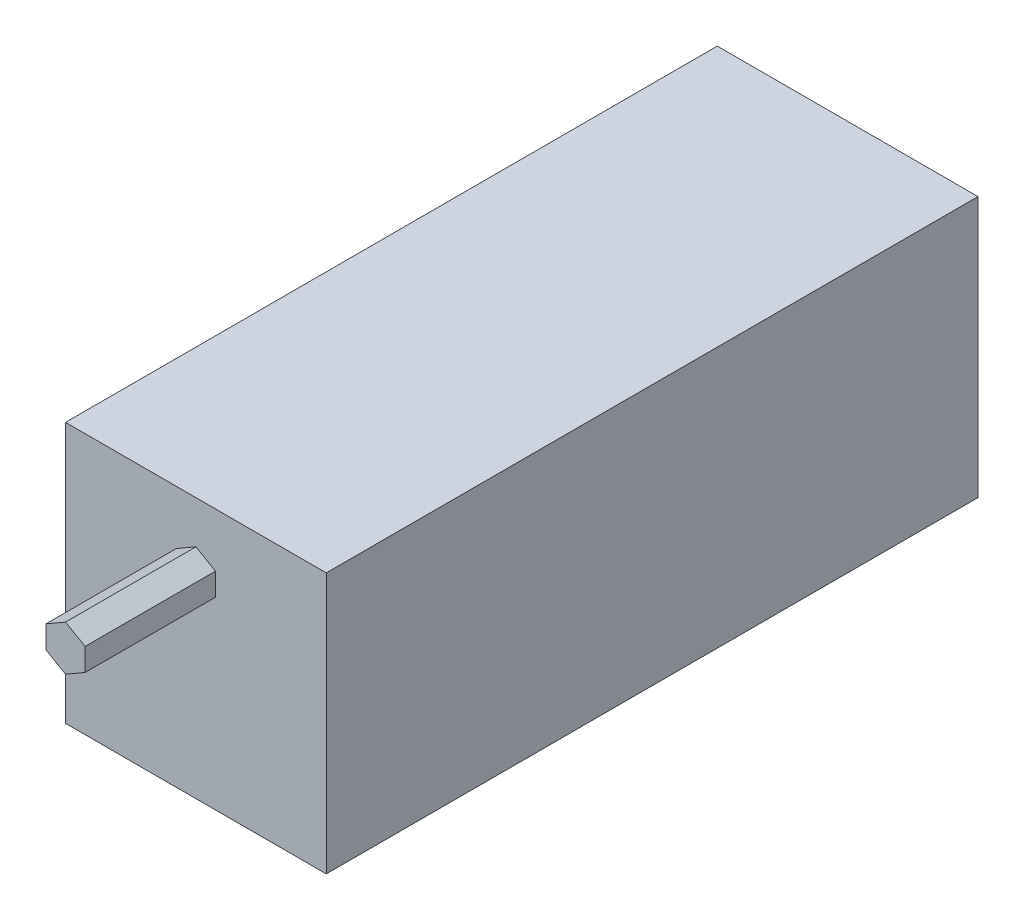
ISO-10303-21;
HEADER;
FILE_DESCRIPTION(('STEP AP214'),'2;1');
FILE_NAME('part.step','',(''),(''),'','','');
FILE_SCHEMA(('AUTOMOTIVE_DESIGN { 1 0 10303 214 1 1 1 1 }'));
ENDSEC;
DATA;
#1=APPLICATION_CONTEXT('core data for automotive mechanical design processes');
#2=APPLICATION_PROTOCOL_DEFINITION('international standard','automotive_design',2000,#1);
#3=PRODUCT_CONTEXT('',#1,'mechanical');
#4=PRODUCT('Part','Part','',(#3));
#5=PRODUCT_RELATED_PRODUCT_CATEGORY('part','',(#4));
#6=PRODUCT_DEFINITION_FORMATION('','',#4);
#7=PRODUCT_DEFINITION_CONTEXT('part definition',#1,'design');
#8=PRODUCT_DEFINITION('design','',#6,#7);
#9=PRODUCT_DEFINITION_SHAPE('','',#8);
#10=(LENGTH_UNIT() NAMED_UNIT(*) SI_UNIT(.MILLI.,.METRE.));
#11=(NAMED_UNIT(*) PLANE_ANGLE_UNIT() SI_UNIT($,.RADIAN.));
#12=(NAMED_UNIT(*) SI_UNIT($,.STERADIAN.) SOLID_ANGLE_UNIT());
#13=UNCERTAINTY_MEASURE_WITH_UNIT(LENGTH_MEASURE(1.E-05),#10,'distance_accuracy_value','');
#14=(GEOMETRIC_REPRESENTATION_CONTEXT(3) GLOBAL_UNCERTAINTY_ASSIGNED_CONTEXT((#13)) GLOBAL_UNIT_ASSIGNED_CONTEXT((#10,
#11,#12)) REPRESENTATION_CONTEXT('',''));
#15=CARTESIAN_POINT('',(0.,0.,0.));
#16=DIRECTION('',(0.,0.,1.));
#17=DIRECTION('',(1.,0.,0.));
#18=AXIS2_PLACEMENT_3D('',#15,#16,#17);
#19=CARTESIAN_POINT('',(0.,40.,0.));
#20=DIRECTION('',(0.,0.,-1.));
#21=DIRECTION('',(-1.,0.,0.));
#22=AXIS2_PLACEMENT_3D('',#19,#20,#21);
#23=PLANE('',#22);
#24=DIRECTION('',(1.,0.,0.));
#25=VECTOR('',#24,1.);
#26=CARTESIAN_POINT('',(0.,0.,0.));
#27=LINE('',#26,#25);
#28=CARTESIAN_POINT('',(0.,0.,0.));
#29=VERTEX_POINT('',#28);
#30=CARTESIAN_POINT('',(40.,0.,0.));
#31=VERTEX_POINT('',#30);
#32=EDGE_CURVE('E137',#29,#31,#27,.T.);
#33=ORIENTED_EDGE('',*,*,#32,.T.);
#34=DIRECTION('',(0.,-1.,0.));
#35=VECTOR('',#34,1.);
#36=CARTESIAN_POINT('',(40.,40.,0.));
#37=LINE('',#36,#35);
#38=CARTESIAN_POINT('',(40.,40.,0.));
#39=VERTEX_POINT('',#38);
#40=EDGE_CURVE('E44',#39,#31,#37,.T.);
#41=ORIENTED_EDGE('',*,*,#40,.F.);
#42=DIRECTION('',(1.,0.,0.));
#43=VECTOR('',#42,1.);
#44=CARTESIAN_POINT('',(0.,40.,0.));
#45=LINE('',#44,#43);
#46=CARTESIAN_POINT('',(0.,40.,0.));
#47=VERTEX_POINT('',#46);
#48=EDGE_CURVE('E146',#47,#39,#45,.T.);
#49=ORIENTED_EDGE('',*,*,#48,.F.);
#50=DIRECTION('',(0.,-1.,0.));
#51=VECTOR('',#50,1.);
#52=CARTESIAN_POINT('',(0.,40.,0.));
#53=LINE('',#52,#51);
#54=EDGE_CURVE('E11',#47,#29,#53,.T.);
#55=ORIENTED_EDGE('',*,*,#54,.T.);
#56=EDGE_LOOP('',(#33,#41,#49,#55));
#57=FACE_BOUND('',#56,.T.);
#58=DIRECTION('',(0.866025403784437,0.500000000000002,0.));
#59=VECTOR('',#58,1.);
#60=CARTESIAN_POINT('',(20.,26.5358983848623,0.));
#61=LINE('',#60,#59);
#62=CARTESIAN_POINT('',(20.,26.5358983848623,0.));
#63=VERTEX_POINT('',#62);
#64=CARTESIAN_POINT('',(23.,28.2679491924311,0.));
#65=VERTEX_POINT('',#64);
#66=EDGE_CURVE('E133',#63,#65,#61,.T.);
#67=ORIENTED_EDGE('',*,*,#66,.F.);
#68=DIRECTION('',(0.866025403784441,-0.499999999999995,0.));
#69=VECTOR('',#68,1.);
#70=CARTESIAN_POINT('',(17.,28.2679491924311,0.));
#71=LINE('',#70,#69);
#72=CARTESIAN_POINT('',(17.,28.2679491924311,0.));
#73=VERTEX_POINT('',#72);
#74=EDGE_CURVE('E130',#73,#63,#71,.T.);
#75=ORIENTED_EDGE('',*,*,#74,.F.);
#76=DIRECTION('',(0.,-1.,0.));
#77=VECTOR('',#76,1.);
#78=CARTESIAN_POINT('',(17.,31.7320508075689,0.));
#79=LINE('',#78,#77);
#80=CARTESIAN_POINT('',(17.,31.7320508075689,0.));
#81=VERTEX_POINT('',#80);
#82=EDGE_CURVE('E193',#81,#73,#79,.T.);
#83=ORIENTED_EDGE('',*,*,#82,.F.);
#84=DIRECTION('',(-0.866025403784436,-0.500000000000005,0.));
#85=VECTOR('',#84,1.);
#86=CARTESIAN_POINT('',(20.,33.4641016151378,0.));
#87=LINE('',#86,#85);
#88=CARTESIAN_POINT('',(20.,33.4641016151378,0.));
#89=VERTEX_POINT('',#88);
#90=EDGE_CURVE('E210',#89,#81,#87,.T.);
#91=ORIENTED_EDGE('',*,*,#90,.F.);
#92=DIRECTION('',(-0.866025403784439,0.499999999999999,0.));
#93=VECTOR('',#92,1.);
#94=CARTESIAN_POINT('',(23.,31.7320508075689,0.));
#95=LINE('',#94,#93);
#96=CARTESIAN_POINT('',(23.,31.7320508075689,0.));
#97=VERTEX_POINT('',#96);
#98=EDGE_CURVE('E56',#97,#89,#95,.T.);
#99=ORIENTED_EDGE('',*,*,#98,.F.);
#100=DIRECTION('',(0.,1.,0.));
#101=VECTOR('',#100,1.);
#102=CARTESIAN_POINT('',(23.,28.2679491924311,0.));
#103=LINE('',#102,#101);
#104=EDGE_CURVE('E51',#65,#97,#103,.T.);
#105=ORIENTED_EDGE('',*,*,#104,.F.);
#106=EDGE_LOOP('',(#67,#75,#83,#91,#99,#105));
#107=FACE_BOUND('',#106,.T.);
#108=ADVANCED_FACE('F36',(#57,#107),#23,.F.);
#109=CARTESIAN_POINT('',(0.,40.,0.));
#110=DIRECTION('',(1.,0.,0.));
#111=DIRECTION('',(0.,0.,-1.));
#112=AXIS2_PLACEMENT_3D('',#109,#110,#111);
#113=PLANE('',#112);
#114=DIRECTION('',(0.,0.,1.));
#115=VECTOR('',#114,1.);
#116=CARTESIAN_POINT('',(0.,0.,0.));
#117=LINE('',#116,#115);
#118=CARTESIAN_POINT('',(0.,0.,-100.));
#119=VERTEX_POINT('',#118);
#120=EDGE_CURVE('E134',#119,#29,#117,.T.);
#121=ORIENTED_EDGE('',*,*,#120,.T.);
#122=ORIENTED_EDGE('',*,*,#54,.F.);
#123=DIRECTION('',(0.,0.,1.));
#124=VECTOR('',#123,1.);
#125=CARTESIAN_POINT('',(0.,40.,0.));
#126=LINE('',#125,#124);
#127=CARTESIAN_POINT('',(0.,40.,-100.));
#128=VERTEX_POINT('',#127);
#129=EDGE_CURVE('E143',#128,#47,#126,.T.);
#130=ORIENTED_EDGE('',*,*,#129,.F.);
#131=DIRECTION('',(0.,-1.,0.));
#132=VECTOR('',#131,1.);
#133=CARTESIAN_POINT('',(0.,40.,-100.));
#134=LINE('',#133,#132);
#135=EDGE_CURVE('E152',#128,#119,#134,.T.);
#136=ORIENTED_EDGE('',*,*,#135,.T.);
#137=EDGE_LOOP('',(#121,#122,#130,#136));
#138=FACE_BOUND('',#137,.T.);
#139=ADVANCED_FACE('F38',(#138),#113,.F.);
#140=CARTESIAN_POINT('',(40.,40.,0.));
#141=DIRECTION('',(-1.,0.,0.));
#142=DIRECTION('',(0.,0.,1.));
#143=AXIS2_PLACEMENT_3D('',#140,#141,#142);
#144=PLANE('',#143);
#145=DIRECTION('',(0.,0.,-1.));
#146=VECTOR('',#145,1.);
#147=CARTESIAN_POINT('',(40.,0.,0.));
#148=LINE('',#147,#146);
#149=CARTESIAN_POINT('',(40.,0.,-100.));
#150=VERTEX_POINT('',#149);
#151=EDGE_CURVE('E155',#31,#150,#148,.T.);
#152=ORIENTED_EDGE('',*,*,#151,.T.);
#153=DIRECTION('',(0.,-1.,0.));
#154=VECTOR('',#153,1.);
#155=CARTESIAN_POINT('',(40.,40.,-100.));
#156=LINE('',#155,#154);
#157=CARTESIAN_POINT('',(40.,40.,-100.));
#158=VERTEX_POINT('',#157);
#159=EDGE_CURVE('E160',#158,#150,#156,.T.);
#160=ORIENTED_EDGE('',*,*,#159,.F.);
#161=DIRECTION('',(0.,0.,-1.));
#162=VECTOR('',#161,1.);
#163=CARTESIAN_POINT('',(40.,40.,0.));
#164=LINE('',#163,#162);
#165=EDGE_CURVE('E149',#39,#158,#164,.T.);
#166=ORIENTED_EDGE('',*,*,#165,.F.);
#167=ORIENTED_EDGE('',*,*,#40,.T.);
#168=EDGE_LOOP('',(#152,#160,#166,#167));
#169=FACE_BOUND('',#168,.T.);
#170=ADVANCED_FACE('F167',(#169),#144,.F.);
#171=CARTESIAN_POINT('',(0.,40.,-100.));
#172=DIRECTION('',(0.,0.,1.));
#173=DIRECTION('',(1.,0.,0.));
#174=AXIS2_PLACEMENT_3D('',#171,#172,#173);
#175=PLANE('',#174);
#176=DIRECTION('',(-1.,0.,0.));
#177=VECTOR('',#176,1.);
#178=CARTESIAN_POINT('',(0.,0.,-100.));
#179=LINE('',#178,#177);
#180=EDGE_CURVE('E147',#150,#119,#179,.T.);
#181=ORIENTED_EDGE('',*,*,#180,.T.);
#182=ORIENTED_EDGE('',*,*,#135,.F.);
#183=DIRECTION('',(-1.,0.,0.));
#184=VECTOR('',#183,1.);
#185=CARTESIAN_POINT('',(0.,40.,-100.));
#186=LINE('',#185,#184);
#187=EDGE_CURVE('E151',#158,#128,#186,.T.);
#188=ORIENTED_EDGE('',*,*,#187,.F.);
#189=ORIENTED_EDGE('',*,*,#159,.T.);
#190=EDGE_LOOP('',(#181,#182,#188,#189));
#191=FACE_BOUND('',#190,.T.);
#192=ADVANCED_FACE('F176',(#191),#175,.F.);
#193=CARTESIAN_POINT('',(0.,40.,0.));
#194=DIRECTION('',(0.,-1.,0.));
#195=DIRECTION('',(0.,0.,-1.));
#196=AXIS2_PLACEMENT_3D('',#193,#194,#195);
#197=PLANE('',#196);
#198=ORIENTED_EDGE('',*,*,#129,.T.);
#199=ORIENTED_EDGE('',*,*,#48,.T.);
#200=ORIENTED_EDGE('',*,*,#165,.T.);
#201=ORIENTED_EDGE('',*,*,#187,.T.);
#202=EDGE_LOOP('',(#198,#199,#200,#201));
#203=FACE_BOUND('',#202,.T.);
#204=ADVANCED_FACE('F182',(#203),#197,.F.);
#205=CARTESIAN_POINT('',(0.,0.,0.));
#206=DIRECTION('',(0.,-1.,0.));
#207=DIRECTION('',(0.,0.,-1.));
#208=AXIS2_PLACEMENT_3D('',#205,#206,#207);
#209=PLANE('',#208);
#210=ORIENTED_EDGE('',*,*,#120,.F.);
#211=ORIENTED_EDGE('',*,*,#180,.F.);
#212=ORIENTED_EDGE('',*,*,#151,.F.);
#213=ORIENTED_EDGE('',*,*,#32,.F.);
#214=EDGE_LOOP('',(#210,#211,#212,#213));
#215=FACE_BOUND('',#214,.T.);
#216=ADVANCED_FACE('F173',(#215),#209,.T.);
#217=CARTESIAN_POINT('',(20.,26.5358983848623,20.));
#218=DIRECTION('',(-0.500000000000003,0.866025403784437,0.));
#219=DIRECTION('',(-0.866025403784437,-0.500000000000003,0.));
#220=AXIS2_PLACEMENT_3D('',#217,#218,#219);
#221=PLANE('',#220);
#222=ORIENTED_EDGE('',*,*,#66,.T.);
#223=DIRECTION('',(0.,0.,-1.));
#224=VECTOR('',#223,1.);
#225=CARTESIAN_POINT('',(23.,28.2679491924311,20.));
#226=LINE('',#225,#224);
#227=CARTESIAN_POINT('',(23.,28.2679491924311,20.));
#228=VERTEX_POINT('',#227);
#229=EDGE_CURVE('E114',#228,#65,#226,.T.);
#230=ORIENTED_EDGE('',*,*,#229,.F.);
#231=DIRECTION('',(0.866025403784437,0.500000000000002,0.));
#232=VECTOR('',#231,1.);
#233=CARTESIAN_POINT('',(20.,26.5358983848623,20.));
#234=LINE('',#233,#232);
#235=CARTESIAN_POINT('',(20.,26.5358983848623,20.));
#236=VERTEX_POINT('',#235);
#237=EDGE_CURVE('E121',#236,#228,#234,.T.);
#238=ORIENTED_EDGE('',*,*,#237,.F.);
#239=DIRECTION('',(0.,0.,-1.));
#240=VECTOR('',#239,1.);
#241=CARTESIAN_POINT('',(20.,26.5358983848623,20.));
#242=LINE('',#241,#240);
#243=EDGE_CURVE('E190',#236,#63,#242,.T.);
#244=ORIENTED_EDGE('',*,*,#243,.T.);
#245=EDGE_LOOP('',(#222,#230,#238,#244));
#246=FACE_BOUND('',#245,.T.);
#247=ADVANCED_FACE('F132',(#246),#221,.F.);
#248=CARTESIAN_POINT('',(23.,28.2679491924311,20.));
#249=DIRECTION('',(-1.,0.,0.));
#250=DIRECTION('',(0.,-1.,0.));
#251=AXIS2_PLACEMENT_3D('',#248,#249,#250);
#252=PLANE('',#251);
#253=ORIENTED_EDGE('',*,*,#104,.T.);
#254=DIRECTION('',(0.,0.,-1.));
#255=VECTOR('',#254,1.);
#256=CARTESIAN_POINT('',(23.,31.7320508075689,20.));
#257=LINE('',#256,#255);
#258=CARTESIAN_POINT('',(23.,31.7320508075689,20.));
#259=VERTEX_POINT('',#258);
#260=EDGE_CURVE('E117',#259,#97,#257,.T.);
#261=ORIENTED_EDGE('',*,*,#260,.F.);
#262=DIRECTION('',(0.,1.,0.));
#263=VECTOR('',#262,1.);
#264=CARTESIAN_POINT('',(23.,28.2679491924311,20.));
#265=LINE('',#264,#263);
#266=EDGE_CURVE('E110',#228,#259,#265,.T.);
#267=ORIENTED_EDGE('',*,*,#266,.F.);
#268=ORIENTED_EDGE('',*,*,#229,.T.);
#269=EDGE_LOOP('',(#253,#261,#267,#268));
#270=FACE_BOUND('',#269,.T.);
#271=ADVANCED_FACE('F112',(#270),#252,.F.);
#272=CARTESIAN_POINT('',(23.,31.7320508075689,20.));
#273=DIRECTION('',(-0.499999999999999,-0.866025403784439,0.));
#274=DIRECTION('',(0.866025403784439,-0.499999999999999,0.));
#275=AXIS2_PLACEMENT_3D('',#272,#273,#274);
#276=PLANE('',#275);
#277=ORIENTED_EDGE('',*,*,#98,.T.);
#278=DIRECTION('',(0.,0.,-1.));
#279=VECTOR('',#278,1.);
#280=CARTESIAN_POINT('',(20.,33.4641016151378,20.));
#281=LINE('',#280,#279);
#282=CARTESIAN_POINT('',(20.,33.4641016151378,20.));
#283=VERTEX_POINT('',#282);
#284=EDGE_CURVE('E139',#283,#89,#281,.T.);
#285=ORIENTED_EDGE('',*,*,#284,.F.);
#286=DIRECTION('',(-0.866025403784439,0.499999999999999,0.));
#287=VECTOR('',#286,1.);
#288=CARTESIAN_POINT('',(23.,31.7320508075689,20.));
#289=LINE('',#288,#287);
#290=EDGE_CURVE('E120',#259,#283,#289,.T.);
#291=ORIENTED_EDGE('',*,*,#290,.F.);
#292=ORIENTED_EDGE('',*,*,#260,.T.);
#293=EDGE_LOOP('',(#277,#285,#291,#292));
#294=FACE_BOUND('',#293,.T.);
#295=ADVANCED_FACE('F213',(#294),#276,.F.);
#296=CARTESIAN_POINT('',(20.,33.4641016151378,20.));
#297=DIRECTION('',(0.500000000000005,-0.866025403784436,0.));
#298=DIRECTION('',(0.866025403784436,0.500000000000005,0.));
#299=AXIS2_PLACEMENT_3D('',#296,#297,#298);
#300=PLANE('',#299);
#301=ORIENTED_EDGE('',*,*,#90,.T.);
#302=DIRECTION('',(0.,0.,-1.));
#303=VECTOR('',#302,1.);
#304=CARTESIAN_POINT('',(17.,31.7320508075689,20.));
#305=LINE('',#304,#303);
#306=CARTESIAN_POINT('',(17.,31.7320508075689,20.));
#307=VERTEX_POINT('',#306);
#308=EDGE_CURVE('E196',#307,#81,#305,.T.);
#309=ORIENTED_EDGE('',*,*,#308,.F.);
#310=DIRECTION('',(-0.866025403784436,-0.500000000000005,0.));
#311=VECTOR('',#310,1.);
#312=CARTESIAN_POINT('',(20.,33.4641016151378,20.));
#313=LINE('',#312,#311);
#314=EDGE_CURVE('E211',#283,#307,#313,.T.);
#315=ORIENTED_EDGE('',*,*,#314,.F.);
#316=ORIENTED_EDGE('',*,*,#284,.T.);
#317=EDGE_LOOP('',(#301,#309,#315,#316));
#318=FACE_BOUND('',#317,.T.);
#319=ADVANCED_FACE('F208',(#318),#300,.F.);
#320=CARTESIAN_POINT('',(17.,31.7320508075689,20.));
#321=DIRECTION('',(1.,0.,0.));
#322=DIRECTION('',(0.,1.,0.));
#323=AXIS2_PLACEMENT_3D('',#320,#321,#322);
#324=PLANE('',#323);
#325=ORIENTED_EDGE('',*,*,#82,.T.);
#326=DIRECTION('',(0.,0.,-1.));
#327=VECTOR('',#326,1.);
#328=CARTESIAN_POINT('',(17.,28.2679491924311,20.));
#329=LINE('',#328,#327);
#330=CARTESIAN_POINT('',(17.,28.2679491924311,20.));
#331=VERTEX_POINT('',#330);
#332=EDGE_CURVE('E192',#331,#73,#329,.T.);
#333=ORIENTED_EDGE('',*,*,#332,.F.);
#334=DIRECTION('',(0.,-1.,0.));
#335=VECTOR('',#334,1.);
#336=CARTESIAN_POINT('',(17.,31.7320508075689,20.));
#337=LINE('',#336,#335);
#338=EDGE_CURVE('E198',#307,#331,#337,.T.);
#339=ORIENTED_EDGE('',*,*,#338,.F.);
#340=ORIENTED_EDGE('',*,*,#308,.T.);
#341=EDGE_LOOP('',(#325,#333,#339,#340));
#342=FACE_BOUND('',#341,.T.);
#343=ADVANCED_FACE('F218',(#342),#324,.F.);
#344=CARTESIAN_POINT('',(17.,28.2679491924311,20.));
#345=DIRECTION('',(0.499999999999995,0.866025403784442,0.));
#346=DIRECTION('',(-0.866025403784442,0.499999999999995,0.));
#347=AXIS2_PLACEMENT_3D('',#344,#345,#346);
#348=PLANE('',#347);
#349=ORIENTED_EDGE('',*,*,#74,.T.);
#350=ORIENTED_EDGE('',*,*,#243,.F.);
#351=DIRECTION('',(0.866025403784441,-0.499999999999995,0.));
#352=VECTOR('',#351,1.);
#353=CARTESIAN_POINT('',(17.,28.2679491924311,20.));
#354=LINE('',#353,#352);
#355=EDGE_CURVE('E126',#331,#236,#354,.T.);
#356=ORIENTED_EDGE('',*,*,#355,.F.);
#357=ORIENTED_EDGE('',*,*,#332,.T.);
#358=EDGE_LOOP('',(#349,#350,#356,#357));
#359=FACE_BOUND('',#358,.T.);
#360=ADVANCED_FACE('F189',(#359),#348,.F.);
#361=CARTESIAN_POINT('',(0.,0.,20.));
#362=DIRECTION('',(0.,0.,1.));
#363=DIRECTION('',(1.,0.,0.));
#364=AXIS2_PLACEMENT_3D('',#361,#362,#363);
#365=PLANE('',#364);
#366=ORIENTED_EDGE('',*,*,#237,.T.);
#367=ORIENTED_EDGE('',*,*,#266,.T.);
#368=ORIENTED_EDGE('',*,*,#290,.T.);
#369=ORIENTED_EDGE('',*,*,#314,.T.);
#370=ORIENTED_EDGE('',*,*,#338,.T.);
#371=ORIENTED_EDGE('',*,*,#355,.T.);
#372=EDGE_LOOP('',(#366,#367,#368,#369,#370,#371));
#373=FACE_BOUND('',#372,.T.);
#374=ADVANCED_FACE('F124',(#373),#365,.T.);
#375=CLOSED_SHELL('',(#108,#139,#170,#192,#204,#216,#247,#271,#295,#319,#343,#360,#374));
#376=MANIFOLD_SOLID_BREP('B2',#375);
#377=ADVANCED_BREP_SHAPE_REPRESENTATION('',(#18,#376),#14);
#378=SHAPE_DEFINITION_REPRESENTATION(#9,#377);
ENDSEC;
END-ISO-10303-21;
